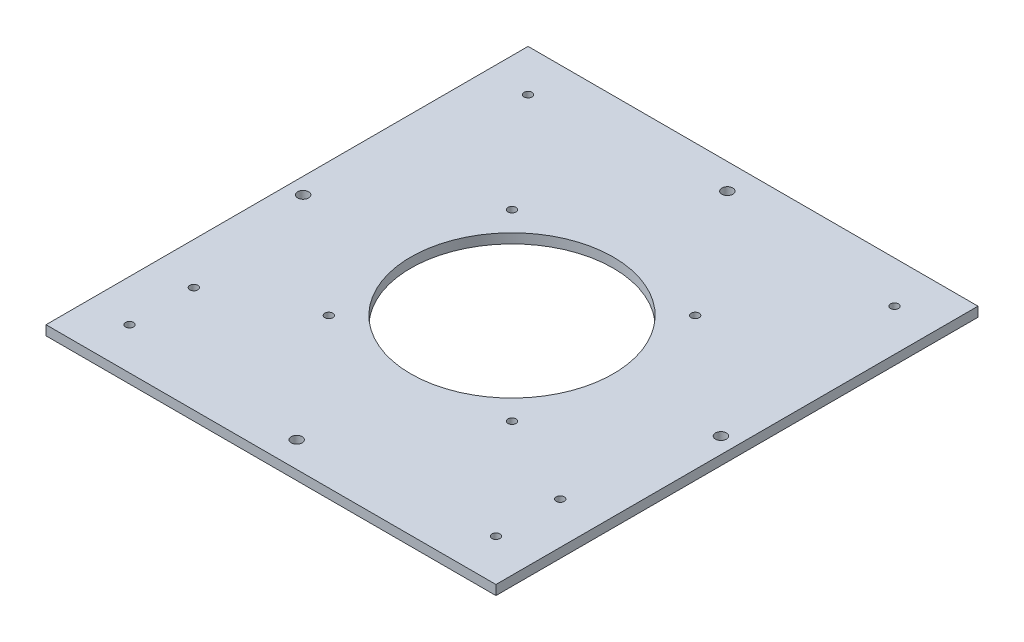
ISO-10303-21;
HEADER;
FILE_DESCRIPTION(('STEP AP214'),'2;1');
FILE_NAME('part.step','',(''),(''),'','','');
FILE_SCHEMA(('AUTOMOTIVE_DESIGN { 1 0 10303 214 1 1 1 1 }'));
ENDSEC;
DATA;
#1=APPLICATION_CONTEXT('core data for automotive mechanical design processes');
#2=APPLICATION_PROTOCOL_DEFINITION('international standard','automotive_design',2000,#1);
#3=PRODUCT_CONTEXT('',#1,'mechanical');
#4=PRODUCT('Part','Part','',(#3));
#5=PRODUCT_RELATED_PRODUCT_CATEGORY('part','',(#4));
#6=PRODUCT_DEFINITION_FORMATION('','',#4);
#7=PRODUCT_DEFINITION_CONTEXT('part definition',#1,'design');
#8=PRODUCT_DEFINITION('design','',#6,#7);
#9=PRODUCT_DEFINITION_SHAPE('','',#8);
#10=(LENGTH_UNIT() NAMED_UNIT(*) SI_UNIT(.MILLI.,.METRE.));
#11=(NAMED_UNIT(*) PLANE_ANGLE_UNIT() SI_UNIT($,.RADIAN.));
#12=(NAMED_UNIT(*) SI_UNIT($,.STERADIAN.) SOLID_ANGLE_UNIT());
#13=UNCERTAINTY_MEASURE_WITH_UNIT(LENGTH_MEASURE(1.E-05),#10,'distance_accuracy_value','');
#14=(GEOMETRIC_REPRESENTATION_CONTEXT(3) GLOBAL_UNCERTAINTY_ASSIGNED_CONTEXT((#13)) GLOBAL_UNIT_ASSIGNED_CONTEXT((#10,
#11,#12)) REPRESENTATION_CONTEXT('',''));
#15=CARTESIAN_POINT('',(0.,0.,0.));
#16=DIRECTION('',(0.,0.,1.));
#17=DIRECTION('',(1.,0.,0.));
#18=AXIS2_PLACEMENT_3D('',#15,#16,#17);
#19=CARTESIAN_POINT('',(12.,224.057982809084,290.032139168121));
#20=DIRECTION('',(0.,1.,0.));
#21=DIRECTION('',(0.,0.,1.));
#22=AXIS2_PLACEMENT_3D('',#19,#20,#21);
#23=PLANE('',#22);
#24=CARTESIAN_POINT('',(139.,224.057982809084,137.));
#25=DIRECTION('',(0.,-1.,0.));
#26=DIRECTION('',(0.,0.,-1.));
#27=AXIS2_PLACEMENT_3D('',#24,#25,#26);
#28=CIRCLE('',#27,1.25);
#29=CARTESIAN_POINT('',(139.,224.057982809084,135.75));
#30=VERTEX_POINT('',#29);
#31=EDGE_CURVE('E135',#30,#30,#28,.T.);
#32=ORIENTED_EDGE('',*,*,#31,.F.);
#33=EDGE_LOOP('',(#32));
#34=FACE_BOUND('',#33,.T.);
#35=CARTESIAN_POINT('',(139.,224.057982809084,117.));
#36=DIRECTION('',(0.,-1.,0.));
#37=DIRECTION('',(0.,0.,-1.));
#38=AXIS2_PLACEMENT_3D('',#35,#36,#37);
#39=CIRCLE('',#38,1.25);
#40=CARTESIAN_POINT('',(139.,224.057982809084,115.75));
#41=VERTEX_POINT('',#40);
#42=EDGE_CURVE('E139',#41,#41,#39,.T.);
#43=ORIENTED_EDGE('',*,*,#42,.F.);
#44=EDGE_LOOP('',(#43));
#45=FACE_BOUND('',#44,.T.);
#46=CARTESIAN_POINT('',(139.,224.057982809084,13.));
#47=DIRECTION('',(0.,-1.,0.));
#48=DIRECTION('',(0.,0.,-1.));
#49=AXIS2_PLACEMENT_3D('',#46,#47,#48);
#50=CIRCLE('',#49,1.25);
#51=CARTESIAN_POINT('',(139.,224.057982809084,11.75));
#52=VERTEX_POINT('',#51);
#53=EDGE_CURVE('E143',#52,#52,#50,.T.);
#54=ORIENTED_EDGE('',*,*,#53,.F.);
#55=EDGE_LOOP('',(#54));
#56=FACE_BOUND('',#55,.T.);
#57=CARTESIAN_POINT('',(25.,224.057982809084,137.));
#58=DIRECTION('',(0.,-1.,0.));
#59=DIRECTION('',(0.,0.,-1.));
#60=AXIS2_PLACEMENT_3D('',#57,#58,#59);
#61=CIRCLE('',#60,1.25);
#62=CARTESIAN_POINT('',(25.,224.057982809084,135.75));
#63=VERTEX_POINT('',#62);
#64=EDGE_CURVE('E147',#63,#63,#61,.T.);
#65=ORIENTED_EDGE('',*,*,#64,.F.);
#66=EDGE_LOOP('',(#65));
#67=FACE_BOUND('',#66,.T.);
#68=CARTESIAN_POINT('',(25.,224.057982809084,117.));
#69=DIRECTION('',(0.,-1.,0.));
#70=DIRECTION('',(0.,0.,-1.));
#71=AXIS2_PLACEMENT_3D('',#68,#69,#70);
#72=CIRCLE('',#71,1.25);
#73=CARTESIAN_POINT('',(25.,224.057982809084,115.75));
#74=VERTEX_POINT('',#73);
#75=EDGE_CURVE('E151',#74,#74,#72,.T.);
#76=ORIENTED_EDGE('',*,*,#75,.F.);
#77=EDGE_LOOP('',(#76));
#78=FACE_BOUND('',#77,.T.);
#79=CARTESIAN_POINT('',(25.,224.057982809084,13.));
#80=DIRECTION('',(0.,-1.,0.));
#81=DIRECTION('',(0.,0.,-1.));
#82=AXIS2_PLACEMENT_3D('',#79,#80,#81);
#83=CIRCLE('',#82,1.25);
#84=CARTESIAN_POINT('',(25.,224.057982809084,11.75));
#85=VERTEX_POINT('',#84);
#86=EDGE_CURVE('E155',#85,#85,#83,.T.);
#87=ORIENTED_EDGE('',*,*,#86,.F.);
#88=EDGE_LOOP('',(#87));
#89=FACE_BOUND('',#88,.T.);
#90=CARTESIAN_POINT('',(82.,224.057982809084,142.));
#91=DIRECTION('',(0.,-1.,0.));
#92=DIRECTION('',(0.,0.,-1.));
#93=AXIS2_PLACEMENT_3D('',#90,#91,#92);
#94=CIRCLE('',#93,1.69999999999999);
#95=CARTESIAN_POINT('',(82.,224.057982809084,140.3));
#96=VERTEX_POINT('',#95);
#97=EDGE_CURVE('E159',#96,#96,#94,.T.);
#98=ORIENTED_EDGE('',*,*,#97,.F.);
#99=EDGE_LOOP('',(#98));
#100=FACE_BOUND('',#99,.T.);
#101=CARTESIAN_POINT('',(147.,224.057982809084,75.));
#102=DIRECTION('',(0.,-1.,0.));
#103=DIRECTION('',(0.,0.,-1.));
#104=AXIS2_PLACEMENT_3D('',#101,#102,#103);
#105=CIRCLE('',#104,1.70000000000001);
#106=CARTESIAN_POINT('',(147.,224.057982809084,73.3));
#107=VERTEX_POINT('',#106);
#108=EDGE_CURVE('E163',#107,#107,#105,.T.);
#109=ORIENTED_EDGE('',*,*,#108,.F.);
#110=EDGE_LOOP('',(#109));
#111=FACE_BOUND('',#110,.T.);
#112=CARTESIAN_POINT('',(82.,224.057982809084,7.99999999999998));
#113=DIRECTION('',(0.,-1.,0.));
#114=DIRECTION('',(0.,0.,-1.));
#115=AXIS2_PLACEMENT_3D('',#112,#113,#114);
#116=CIRCLE('',#115,1.69999999999999);
#117=CARTESIAN_POINT('',(82.,224.057982809084,6.29999999999999));
#118=VERTEX_POINT('',#117);
#119=EDGE_CURVE('E167',#118,#118,#116,.T.);
#120=ORIENTED_EDGE('',*,*,#119,.F.);
#121=EDGE_LOOP('',(#120));
#122=FACE_BOUND('',#121,.T.);
#123=CARTESIAN_POINT('',(17.,224.057982809084,75.));
#124=DIRECTION('',(0.,-1.,0.));
#125=DIRECTION('',(0.,0.,-1.));
#126=AXIS2_PLACEMENT_3D('',#123,#124,#125);
#127=CIRCLE('',#126,1.7);
#128=CARTESIAN_POINT('',(17.,224.057982809084,73.3));
#129=VERTEX_POINT('',#128);
#130=EDGE_CURVE('E171',#129,#129,#127,.T.);
#131=ORIENTED_EDGE('',*,*,#130,.F.);
#132=EDGE_LOOP('',(#131));
#133=FACE_BOUND('',#132,.T.);
#134=CARTESIAN_POINT('',(53.5,224.057982809084,103.5));
#135=DIRECTION('',(0.,-1.,0.));
#136=DIRECTION('',(0.,0.,-1.));
#137=AXIS2_PLACEMENT_3D('',#134,#135,#136);
#138=CIRCLE('',#137,1.24999999999999);
#139=CARTESIAN_POINT('',(53.5,224.057982809084,102.25));
#140=VERTEX_POINT('',#139);
#141=EDGE_CURVE('E175',#140,#140,#138,.T.);
#142=ORIENTED_EDGE('',*,*,#141,.F.);
#143=EDGE_LOOP('',(#142));
#144=FACE_BOUND('',#143,.T.);
#145=CARTESIAN_POINT('',(53.5,224.057982809084,46.5));
#146=DIRECTION('',(0.,-1.,0.));
#147=DIRECTION('',(0.,0.,-1.));
#148=AXIS2_PLACEMENT_3D('',#145,#146,#147);
#149=CIRCLE('',#148,1.24999999999999);
#150=CARTESIAN_POINT('',(53.5,224.057982809084,45.25));
#151=VERTEX_POINT('',#150);
#152=EDGE_CURVE('E179',#151,#151,#149,.T.);
#153=ORIENTED_EDGE('',*,*,#152,.F.);
#154=EDGE_LOOP('',(#153));
#155=FACE_BOUND('',#154,.T.);
#156=CARTESIAN_POINT('',(110.5,224.057982809084,103.5));
#157=DIRECTION('',(0.,-1.,0.));
#158=DIRECTION('',(0.,0.,-1.));
#159=AXIS2_PLACEMENT_3D('',#156,#157,#158);
#160=CIRCLE('',#159,1.24999999999999);
#161=CARTESIAN_POINT('',(110.5,224.057982809084,102.25));
#162=VERTEX_POINT('',#161);
#163=EDGE_CURVE('E183',#162,#162,#160,.T.);
#164=ORIENTED_EDGE('',*,*,#163,.F.);
#165=EDGE_LOOP('',(#164));
#166=FACE_BOUND('',#165,.T.);
#167=CARTESIAN_POINT('',(82.,224.057982809084,75.));
#168=DIRECTION('',(0.,-1.,0.));
#169=DIRECTION('',(0.,0.,-1.));
#170=AXIS2_PLACEMENT_3D('',#167,#168,#169);
#171=CIRCLE('',#170,31.5);
#172=CARTESIAN_POINT('',(82.,224.057982809084,43.5));
#173=VERTEX_POINT('',#172);
#174=EDGE_CURVE('E92',#173,#173,#171,.T.);
#175=ORIENTED_EDGE('',*,*,#174,.F.);
#176=EDGE_LOOP('',(#175));
#177=FACE_BOUND('',#176,.T.);
#178=DIRECTION('',(0.,0.,-1.));
#179=VECTOR('',#178,1.);
#180=CARTESIAN_POINT('',(152.,224.057982809084,290.032139168121));
#181=LINE('',#180,#179);
#182=CARTESIAN_POINT('',(152.,224.057982809084,150.));
#183=VERTEX_POINT('',#182);
#184=CARTESIAN_POINT('',(152.,224.057982809084,0.));
#185=VERTEX_POINT('',#184);
#186=EDGE_CURVE('E74',#183,#185,#181,.T.);
#187=ORIENTED_EDGE('',*,*,#186,.F.);
#188=DIRECTION('',(-1.,0.,0.));
#189=VECTOR('',#188,1.);
#190=CARTESIAN_POINT('',(12.,224.057982809084,150.));
#191=LINE('',#190,#189);
#192=CARTESIAN_POINT('',(12.,224.057982809084,150.));
#193=VERTEX_POINT('',#192);
#194=EDGE_CURVE('E44',#183,#193,#191,.T.);
#195=ORIENTED_EDGE('',*,*,#194,.T.);
#196=DIRECTION('',(0.,0.,-1.));
#197=VECTOR('',#196,1.);
#198=CARTESIAN_POINT('',(12.,224.057982809084,290.032139168121));
#199=LINE('',#198,#197);
#200=CARTESIAN_POINT('',(12.,224.057982809084,0.));
#201=VERTEX_POINT('',#200);
#202=EDGE_CURVE('E88',#193,#201,#199,.T.);
#203=ORIENTED_EDGE('',*,*,#202,.T.);
#204=DIRECTION('',(1.,0.,0.));
#205=VECTOR('',#204,1.);
#206=CARTESIAN_POINT('',(12.,224.057982809084,0.));
#207=LINE('',#206,#205);
#208=EDGE_CURVE('E85',#201,#185,#207,.T.);
#209=ORIENTED_EDGE('',*,*,#208,.T.);
#210=EDGE_LOOP('',(#187,#195,#203,#209));
#211=FACE_BOUND('',#210,.T.);
#212=CARTESIAN_POINT('',(110.5,224.057982809084,46.5));
#213=DIRECTION('',(0.,-1.,0.));
#214=DIRECTION('',(0.,0.,-1.));
#215=AXIS2_PLACEMENT_3D('',#212,#213,#214);
#216=CIRCLE('',#215,1.24999999999999);
#217=CARTESIAN_POINT('',(110.5,224.057982809084,45.25));
#218=VERTEX_POINT('',#217);
#219=EDGE_CURVE('E196',#218,#218,#216,.T.);
#220=ORIENTED_EDGE('',*,*,#219,.F.);
#221=EDGE_LOOP('',(#220));
#222=FACE_BOUND('',#221,.T.);
#223=ADVANCED_FACE('F37',(#34,#45,#56,#67,#78,#89,#100,#111,#122,#133,#144,#155,#166,#177,#211,
#222),#23,.F.);
#224=CARTESIAN_POINT('',(12.,227.057982809084,290.032139168121));
#225=DIRECTION('',(0.,1.,0.));
#226=DIRECTION('',(0.,0.,1.));
#227=AXIS2_PLACEMENT_3D('',#224,#225,#226);
#228=PLANE('',#227);
#229=CARTESIAN_POINT('',(139.,227.057982809084,137.));
#230=DIRECTION('',(0.,-1.,0.));
#231=DIRECTION('',(0.,0.,-1.));
#232=AXIS2_PLACEMENT_3D('',#229,#230,#231);
#233=CIRCLE('',#232,1.25);
#234=CARTESIAN_POINT('',(139.,227.057982809084,135.75));
#235=VERTEX_POINT('',#234);
#236=EDGE_CURVE('E243',#235,#235,#233,.T.);
#237=ORIENTED_EDGE('',*,*,#236,.T.);
#238=EDGE_LOOP('',(#237));
#239=FACE_BOUND('',#238,.T.);
#240=CARTESIAN_POINT('',(139.,227.057982809084,117.));
#241=DIRECTION('',(0.,-1.,0.));
#242=DIRECTION('',(0.,0.,-1.));
#243=AXIS2_PLACEMENT_3D('',#240,#241,#242);
#244=CIRCLE('',#243,1.25);
#245=CARTESIAN_POINT('',(139.,227.057982809084,115.75));
#246=VERTEX_POINT('',#245);
#247=EDGE_CURVE('E239',#246,#246,#244,.T.);
#248=ORIENTED_EDGE('',*,*,#247,.T.);
#249=EDGE_LOOP('',(#248));
#250=FACE_BOUND('',#249,.T.);
#251=CARTESIAN_POINT('',(139.,227.057982809084,13.));
#252=DIRECTION('',(0.,-1.,0.));
#253=DIRECTION('',(0.,0.,-1.));
#254=AXIS2_PLACEMENT_3D('',#251,#252,#253);
#255=CIRCLE('',#254,1.25);
#256=CARTESIAN_POINT('',(139.,227.057982809084,11.75));
#257=VERTEX_POINT('',#256);
#258=EDGE_CURVE('E235',#257,#257,#255,.T.);
#259=ORIENTED_EDGE('',*,*,#258,.T.);
#260=EDGE_LOOP('',(#259));
#261=FACE_BOUND('',#260,.T.);
#262=CARTESIAN_POINT('',(25.,227.057982809084,137.));
#263=DIRECTION('',(0.,-1.,0.));
#264=DIRECTION('',(0.,0.,-1.));
#265=AXIS2_PLACEMENT_3D('',#262,#263,#264);
#266=CIRCLE('',#265,1.25);
#267=CARTESIAN_POINT('',(25.,227.057982809084,135.75));
#268=VERTEX_POINT('',#267);
#269=EDGE_CURVE('E231',#268,#268,#266,.T.);
#270=ORIENTED_EDGE('',*,*,#269,.T.);
#271=EDGE_LOOP('',(#270));
#272=FACE_BOUND('',#271,.T.);
#273=CARTESIAN_POINT('',(25.,227.057982809084,117.));
#274=DIRECTION('',(0.,-1.,0.));
#275=DIRECTION('',(0.,0.,-1.));
#276=AXIS2_PLACEMENT_3D('',#273,#274,#275);
#277=CIRCLE('',#276,1.25);
#278=CARTESIAN_POINT('',(25.,227.057982809084,115.75));
#279=VERTEX_POINT('',#278);
#280=EDGE_CURVE('E227',#279,#279,#277,.T.);
#281=ORIENTED_EDGE('',*,*,#280,.T.);
#282=EDGE_LOOP('',(#281));
#283=FACE_BOUND('',#282,.T.);
#284=CARTESIAN_POINT('',(25.,227.057982809084,13.));
#285=DIRECTION('',(0.,-1.,0.));
#286=DIRECTION('',(0.,0.,-1.));
#287=AXIS2_PLACEMENT_3D('',#284,#285,#286);
#288=CIRCLE('',#287,1.25);
#289=CARTESIAN_POINT('',(25.,227.057982809084,11.75));
#290=VERTEX_POINT('',#289);
#291=EDGE_CURVE('E223',#290,#290,#288,.T.);
#292=ORIENTED_EDGE('',*,*,#291,.T.);
#293=EDGE_LOOP('',(#292));
#294=FACE_BOUND('',#293,.T.);
#295=CARTESIAN_POINT('',(82.,227.057982809084,142.));
#296=DIRECTION('',(0.,-1.,0.));
#297=DIRECTION('',(0.,0.,-1.));
#298=AXIS2_PLACEMENT_3D('',#295,#296,#297);
#299=CIRCLE('',#298,1.69999999999999);
#300=CARTESIAN_POINT('',(82.,227.057982809084,140.3));
#301=VERTEX_POINT('',#300);
#302=EDGE_CURVE('E219',#301,#301,#299,.T.);
#303=ORIENTED_EDGE('',*,*,#302,.T.);
#304=EDGE_LOOP('',(#303));
#305=FACE_BOUND('',#304,.T.);
#306=CARTESIAN_POINT('',(147.,227.057982809084,75.));
#307=DIRECTION('',(0.,-1.,0.));
#308=DIRECTION('',(0.,0.,-1.));
#309=AXIS2_PLACEMENT_3D('',#306,#307,#308);
#310=CIRCLE('',#309,1.70000000000001);
#311=CARTESIAN_POINT('',(147.,227.057982809084,73.3));
#312=VERTEX_POINT('',#311);
#313=EDGE_CURVE('E215',#312,#312,#310,.T.);
#314=ORIENTED_EDGE('',*,*,#313,.T.);
#315=EDGE_LOOP('',(#314));
#316=FACE_BOUND('',#315,.T.);
#317=CARTESIAN_POINT('',(82.,227.057982809084,7.99999999999998));
#318=DIRECTION('',(0.,-1.,0.));
#319=DIRECTION('',(0.,0.,-1.));
#320=AXIS2_PLACEMENT_3D('',#317,#318,#319);
#321=CIRCLE('',#320,1.69999999999999);
#322=CARTESIAN_POINT('',(82.,227.057982809084,6.29999999999999));
#323=VERTEX_POINT('',#322);
#324=EDGE_CURVE('E211',#323,#323,#321,.T.);
#325=ORIENTED_EDGE('',*,*,#324,.T.);
#326=EDGE_LOOP('',(#325));
#327=FACE_BOUND('',#326,.T.);
#328=CARTESIAN_POINT('',(17.,227.057982809084,75.));
#329=DIRECTION('',(0.,-1.,0.));
#330=DIRECTION('',(0.,0.,-1.));
#331=AXIS2_PLACEMENT_3D('',#328,#329,#330);
#332=CIRCLE('',#331,1.7);
#333=CARTESIAN_POINT('',(17.,227.057982809084,73.3));
#334=VERTEX_POINT('',#333);
#335=EDGE_CURVE('E207',#334,#334,#332,.T.);
#336=ORIENTED_EDGE('',*,*,#335,.T.);
#337=EDGE_LOOP('',(#336));
#338=FACE_BOUND('',#337,.T.);
#339=CARTESIAN_POINT('',(53.5,227.057982809084,103.5));
#340=DIRECTION('',(0.,-1.,0.));
#341=DIRECTION('',(0.,0.,-1.));
#342=AXIS2_PLACEMENT_3D('',#339,#340,#341);
#343=CIRCLE('',#342,1.25);
#344=CARTESIAN_POINT('',(53.5,227.057982809084,102.25));
#345=VERTEX_POINT('',#344);
#346=EDGE_CURVE('E203',#345,#345,#343,.T.);
#347=ORIENTED_EDGE('',*,*,#346,.T.);
#348=EDGE_LOOP('',(#347));
#349=FACE_BOUND('',#348,.T.);
#350=CARTESIAN_POINT('',(53.5,227.057982809084,46.5));
#351=DIRECTION('',(0.,-1.,0.));
#352=DIRECTION('',(0.,0.,-1.));
#353=AXIS2_PLACEMENT_3D('',#350,#351,#352);
#354=CIRCLE('',#353,1.25);
#355=CARTESIAN_POINT('',(53.5,227.057982809084,45.25));
#356=VERTEX_POINT('',#355);
#357=EDGE_CURVE('E199',#356,#356,#354,.T.);
#358=ORIENTED_EDGE('',*,*,#357,.T.);
#359=EDGE_LOOP('',(#358));
#360=FACE_BOUND('',#359,.T.);
#361=DIRECTION('',(-1.,0.,0.));
#362=VECTOR('',#361,1.);
#363=CARTESIAN_POINT('',(12.,227.057982809084,150.));
#364=LINE('',#363,#362);
#365=CARTESIAN_POINT('',(152.,227.057982809084,150.));
#366=VERTEX_POINT('',#365);
#367=CARTESIAN_POINT('',(12.,227.057982809084,150.));
#368=VERTEX_POINT('',#367);
#369=EDGE_CURVE('E82',#366,#368,#364,.T.);
#370=ORIENTED_EDGE('',*,*,#369,.F.);
#371=DIRECTION('',(0.,0.,-1.));
#372=VECTOR('',#371,1.);
#373=CARTESIAN_POINT('',(152.,227.057982809084,290.032139168121));
#374=LINE('',#373,#372);
#375=CARTESIAN_POINT('',(152.,227.057982809084,0.));
#376=VERTEX_POINT('',#375);
#377=EDGE_CURVE('E83',#366,#376,#374,.T.);
#378=ORIENTED_EDGE('',*,*,#377,.T.);
#379=DIRECTION('',(1.,0.,0.));
#380=VECTOR('',#379,1.);
#381=CARTESIAN_POINT('',(12.,227.057982809084,0.));
#382=LINE('',#381,#380);
#383=CARTESIAN_POINT('',(12.,227.057982809084,0.));
#384=VERTEX_POINT('',#383);
#385=EDGE_CURVE('E96',#384,#376,#382,.T.);
#386=ORIENTED_EDGE('',*,*,#385,.F.);
#387=DIRECTION('',(0.,0.,-1.));
#388=VECTOR('',#387,1.);
#389=CARTESIAN_POINT('',(12.,227.057982809084,290.032139168121));
#390=LINE('',#389,#388);
#391=EDGE_CURVE('E104',#368,#384,#390,.T.);
#392=ORIENTED_EDGE('',*,*,#391,.F.);
#393=EDGE_LOOP('',(#370,#378,#386,#392));
#394=FACE_BOUND('',#393,.T.);
#395=CARTESIAN_POINT('',(82.,227.057982809084,75.));
#396=DIRECTION('',(0.,1.,0.));
#397=DIRECTION('',(0.,0.,1.));
#398=AXIS2_PLACEMENT_3D('',#395,#396,#397);
#399=CIRCLE('',#398,31.5);
#400=CARTESIAN_POINT('',(82.,227.057982809084,106.5));
#401=VERTEX_POINT('',#400);
#402=EDGE_CURVE('E113',#401,#401,#399,.F.);
#403=ORIENTED_EDGE('',*,*,#402,.T.);
#404=EDGE_LOOP('',(#403));
#405=FACE_BOUND('',#404,.T.);
#406=CARTESIAN_POINT('',(110.5,227.057982809084,103.5));
#407=DIRECTION('',(0.,-1.,0.));
#408=DIRECTION('',(0.,0.,-1.));
#409=AXIS2_PLACEMENT_3D('',#406,#407,#408);
#410=CIRCLE('',#409,1.25);
#411=CARTESIAN_POINT('',(110.5,227.057982809084,102.25));
#412=VERTEX_POINT('',#411);
#413=EDGE_CURVE('E188',#412,#412,#410,.T.);
#414=ORIENTED_EDGE('',*,*,#413,.T.);
#415=EDGE_LOOP('',(#414));
#416=FACE_BOUND('',#415,.T.);
#417=CARTESIAN_POINT('',(110.5,227.057982809084,46.5));
#418=DIRECTION('',(0.,-1.,0.));
#419=DIRECTION('',(0.,0.,-1.));
#420=AXIS2_PLACEMENT_3D('',#417,#418,#419);
#421=CIRCLE('',#420,1.25);
#422=CARTESIAN_POINT('',(110.5,227.057982809084,45.25));
#423=VERTEX_POINT('',#422);
#424=EDGE_CURVE('E193',#423,#423,#421,.T.);
#425=ORIENTED_EDGE('',*,*,#424,.T.);
#426=EDGE_LOOP('',(#425));
#427=FACE_BOUND('',#426,.T.);
#428=ADVANCED_FACE('F107',(#239,#250,#261,#272,#283,#294,#305,#316,#327,#338,#349,#360,#394,
#405,#416,#427),#228,.T.);
#429=CARTESIAN_POINT('',(152.,227.057982809084,290.032139168121));
#430=DIRECTION('',(1.,0.,0.));
#431=DIRECTION('',(0.,0.,-1.));
#432=AXIS2_PLACEMENT_3D('',#429,#430,#431);
#433=PLANE('',#432);
#434=DIRECTION('',(0.,1.,0.));
#435=VECTOR('',#434,1.);
#436=CARTESIAN_POINT('',(152.,227.057982809084,150.));
#437=LINE('',#436,#435);
#438=EDGE_CURVE('E51',#183,#366,#437,.T.);
#439=ORIENTED_EDGE('',*,*,#438,.F.);
#440=ORIENTED_EDGE('',*,*,#186,.T.);
#441=DIRECTION('',(0.,-1.,0.));
#442=VECTOR('',#441,1.);
#443=CARTESIAN_POINT('',(152.,227.057982809084,0.));
#444=LINE('',#443,#442);
#445=EDGE_CURVE('E79',#376,#185,#444,.T.);
#446=ORIENTED_EDGE('',*,*,#445,.F.);
#447=ORIENTED_EDGE('',*,*,#377,.F.);
#448=EDGE_LOOP('',(#439,#440,#446,#447));
#449=FACE_BOUND('',#448,.T.);
#450=ADVANCED_FACE('F76',(#449),#433,.T.);
#451=CARTESIAN_POINT('',(12.,224.057982809084,290.032139168121));
#452=DIRECTION('',(-1.,0.,0.));
#453=DIRECTION('',(0.,0.,1.));
#454=AXIS2_PLACEMENT_3D('',#451,#452,#453);
#455=PLANE('',#454);
#456=DIRECTION('',(0.,-1.,0.));
#457=VECTOR('',#456,1.);
#458=CARTESIAN_POINT('',(12.,224.057982809084,150.));
#459=LINE('',#458,#457);
#460=EDGE_CURVE('E11',#368,#193,#459,.T.);
#461=ORIENTED_EDGE('',*,*,#460,.F.);
#462=ORIENTED_EDGE('',*,*,#391,.T.);
#463=DIRECTION('',(0.,1.,0.));
#464=VECTOR('',#463,1.);
#465=CARTESIAN_POINT('',(12.,224.057982809084,0.));
#466=LINE('',#465,#464);
#467=EDGE_CURVE('E98',#201,#384,#466,.T.);
#468=ORIENTED_EDGE('',*,*,#467,.F.);
#469=ORIENTED_EDGE('',*,*,#202,.F.);
#470=EDGE_LOOP('',(#461,#462,#468,#469));
#471=FACE_BOUND('',#470,.T.);
#472=ADVANCED_FACE('F116',(#471),#455,.T.);
#473=CARTESIAN_POINT('',(0.,0.,0.));
#474=DIRECTION('',(0.,0.,-1.));
#475=DIRECTION('',(-1.,0.,0.));
#476=AXIS2_PLACEMENT_3D('',#473,#474,#475);
#477=PLANE('',#476);
#478=ORIENTED_EDGE('',*,*,#208,.F.);
#479=ORIENTED_EDGE('',*,*,#467,.T.);
#480=ORIENTED_EDGE('',*,*,#385,.T.);
#481=ORIENTED_EDGE('',*,*,#445,.T.);
#482=EDGE_LOOP('',(#478,#479,#480,#481));
#483=FACE_BOUND('',#482,.T.);
#484=ADVANCED_FACE('F94',(#483),#477,.T.);
#485=CARTESIAN_POINT('',(0.,0.,150.));
#486=DIRECTION('',(0.,0.,-1.));
#487=DIRECTION('',(-1.,0.,0.));
#488=AXIS2_PLACEMENT_3D('',#485,#486,#487);
#489=PLANE('',#488);
#490=ORIENTED_EDGE('',*,*,#438,.T.);
#491=ORIENTED_EDGE('',*,*,#369,.T.);
#492=ORIENTED_EDGE('',*,*,#460,.T.);
#493=ORIENTED_EDGE('',*,*,#194,.F.);
#494=EDGE_LOOP('',(#490,#491,#492,#493));
#495=FACE_BOUND('',#494,.T.);
#496=ADVANCED_FACE('F123',(#495),#489,.F.);
#497=CARTESIAN_POINT('',(82.,227.058982809084,75.));
#498=DIRECTION('',(0.,-1.,0.));
#499=DIRECTION('',(0.,0.,-1.));
#500=AXIS2_PLACEMENT_3D('',#497,#498,#499);
#501=CYLINDRICAL_SURFACE('',#500,31.5);
#502=ORIENTED_EDGE('',*,*,#402,.F.);
#503=EDGE_LOOP('',(#502));
#504=FACE_BOUND('',#503,.T.);
#505=ORIENTED_EDGE('',*,*,#174,.T.);
#506=EDGE_LOOP('',(#505));
#507=FACE_BOUND('',#506,.T.);
#508=ADVANCED_FACE('F306',(#504,#507),#501,.F.);
#509=CARTESIAN_POINT('',(110.5,224.057982809084,103.5));
#510=DIRECTION('',(0.,-1.,0.));
#511=DIRECTION('',(0.,0.,-1.));
#512=AXIS2_PLACEMENT_3D('',#509,#510,#511);
#513=CYLINDRICAL_SURFACE('',#512,1.24999999999999);
#514=ORIENTED_EDGE('',*,*,#413,.F.);
#515=EDGE_LOOP('',(#514));
#516=FACE_BOUND('',#515,.T.);
#517=ORIENTED_EDGE('',*,*,#163,.T.);
#518=EDGE_LOOP('',(#517));
#519=FACE_BOUND('',#518,.T.);
#520=ADVANCED_FACE('F302',(#516,#519),#513,.F.);
#521=CARTESIAN_POINT('',(110.5,224.057982809084,46.5));
#522=DIRECTION('',(0.,-1.,0.));
#523=DIRECTION('',(0.,0.,-1.));
#524=AXIS2_PLACEMENT_3D('',#521,#522,#523);
#525=CYLINDRICAL_SURFACE('',#524,1.24999999999999);
#526=ORIENTED_EDGE('',*,*,#424,.F.);
#527=EDGE_LOOP('',(#526));
#528=FACE_BOUND('',#527,.T.);
#529=ORIENTED_EDGE('',*,*,#219,.T.);
#530=EDGE_LOOP('',(#529));
#531=FACE_BOUND('',#530,.T.);
#532=ADVANCED_FACE('F298',(#528,#531),#525,.F.);
#533=CARTESIAN_POINT('',(53.5,224.057982809084,46.5));
#534=DIRECTION('',(0.,-1.,0.));
#535=DIRECTION('',(0.,0.,-1.));
#536=AXIS2_PLACEMENT_3D('',#533,#534,#535);
#537=CYLINDRICAL_SURFACE('',#536,1.24999999999999);
#538=ORIENTED_EDGE('',*,*,#357,.F.);
#539=EDGE_LOOP('',(#538));
#540=FACE_BOUND('',#539,.T.);
#541=ORIENTED_EDGE('',*,*,#152,.T.);
#542=EDGE_LOOP('',(#541));
#543=FACE_BOUND('',#542,.T.);
#544=ADVANCED_FACE('F294',(#540,#543),#537,.F.);
#545=CARTESIAN_POINT('',(53.5,224.057982809084,103.5));
#546=DIRECTION('',(0.,-1.,0.));
#547=DIRECTION('',(0.,0.,-1.));
#548=AXIS2_PLACEMENT_3D('',#545,#546,#547);
#549=CYLINDRICAL_SURFACE('',#548,1.24999999999999);
#550=ORIENTED_EDGE('',*,*,#346,.F.);
#551=EDGE_LOOP('',(#550));
#552=FACE_BOUND('',#551,.T.);
#553=ORIENTED_EDGE('',*,*,#141,.T.);
#554=EDGE_LOOP('',(#553));
#555=FACE_BOUND('',#554,.T.);
#556=ADVANCED_FACE('F290',(#552,#555),#549,.F.);
#557=CARTESIAN_POINT('',(17.,224.057982809084,75.));
#558=DIRECTION('',(0.,-1.,0.));
#559=DIRECTION('',(0.,0.,-1.));
#560=AXIS2_PLACEMENT_3D('',#557,#558,#559);
#561=CYLINDRICAL_SURFACE('',#560,1.7);
#562=ORIENTED_EDGE('',*,*,#335,.F.);
#563=EDGE_LOOP('',(#562));
#564=FACE_BOUND('',#563,.T.);
#565=ORIENTED_EDGE('',*,*,#130,.T.);
#566=EDGE_LOOP('',(#565));
#567=FACE_BOUND('',#566,.T.);
#568=ADVANCED_FACE('F286',(#564,#567),#561,.F.);
#569=CARTESIAN_POINT('',(82.,224.057982809084,7.99999999999998));
#570=DIRECTION('',(0.,-1.,0.));
#571=DIRECTION('',(0.,0.,-1.));
#572=AXIS2_PLACEMENT_3D('',#569,#570,#571);
#573=CYLINDRICAL_SURFACE('',#572,1.69999999999999);
#574=ORIENTED_EDGE('',*,*,#324,.F.);
#575=EDGE_LOOP('',(#574));
#576=FACE_BOUND('',#575,.T.);
#577=ORIENTED_EDGE('',*,*,#119,.T.);
#578=EDGE_LOOP('',(#577));
#579=FACE_BOUND('',#578,.T.);
#580=ADVANCED_FACE('F282',(#576,#579),#573,.F.);
#581=CARTESIAN_POINT('',(147.,224.057982809084,75.));
#582=DIRECTION('',(0.,-1.,0.));
#583=DIRECTION('',(0.,0.,-1.));
#584=AXIS2_PLACEMENT_3D('',#581,#582,#583);
#585=CYLINDRICAL_SURFACE('',#584,1.70000000000001);
#586=ORIENTED_EDGE('',*,*,#313,.F.);
#587=EDGE_LOOP('',(#586));
#588=FACE_BOUND('',#587,.T.);
#589=ORIENTED_EDGE('',*,*,#108,.T.);
#590=EDGE_LOOP('',(#589));
#591=FACE_BOUND('',#590,.T.);
#592=ADVANCED_FACE('F278',(#588,#591),#585,.F.);
#593=CARTESIAN_POINT('',(82.,224.057982809084,142.));
#594=DIRECTION('',(0.,-1.,0.));
#595=DIRECTION('',(0.,0.,-1.));
#596=AXIS2_PLACEMENT_3D('',#593,#594,#595);
#597=CYLINDRICAL_SURFACE('',#596,1.69999999999999);
#598=ORIENTED_EDGE('',*,*,#302,.F.);
#599=EDGE_LOOP('',(#598));
#600=FACE_BOUND('',#599,.T.);
#601=ORIENTED_EDGE('',*,*,#97,.T.);
#602=EDGE_LOOP('',(#601));
#603=FACE_BOUND('',#602,.T.);
#604=ADVANCED_FACE('F274',(#600,#603),#597,.F.);
#605=CARTESIAN_POINT('',(25.,224.057982809084,13.));
#606=DIRECTION('',(0.,-1.,0.));
#607=DIRECTION('',(0.,0.,-1.));
#608=AXIS2_PLACEMENT_3D('',#605,#606,#607);
#609=CYLINDRICAL_SURFACE('',#608,1.25);
#610=ORIENTED_EDGE('',*,*,#291,.F.);
#611=EDGE_LOOP('',(#610));
#612=FACE_BOUND('',#611,.T.);
#613=ORIENTED_EDGE('',*,*,#86,.T.);
#614=EDGE_LOOP('',(#613));
#615=FACE_BOUND('',#614,.T.);
#616=ADVANCED_FACE('F270',(#612,#615),#609,.F.);
#617=CARTESIAN_POINT('',(25.,224.057982809084,117.));
#618=DIRECTION('',(0.,-1.,0.));
#619=DIRECTION('',(0.,0.,-1.));
#620=AXIS2_PLACEMENT_3D('',#617,#618,#619);
#621=CYLINDRICAL_SURFACE('',#620,1.25);
#622=ORIENTED_EDGE('',*,*,#280,.F.);
#623=EDGE_LOOP('',(#622));
#624=FACE_BOUND('',#623,.T.);
#625=ORIENTED_EDGE('',*,*,#75,.T.);
#626=EDGE_LOOP('',(#625));
#627=FACE_BOUND('',#626,.T.);
#628=ADVANCED_FACE('F266',(#624,#627),#621,.F.);
#629=CARTESIAN_POINT('',(25.,224.057982809084,137.));
#630=DIRECTION('',(0.,-1.,0.));
#631=DIRECTION('',(0.,0.,-1.));
#632=AXIS2_PLACEMENT_3D('',#629,#630,#631);
#633=CYLINDRICAL_SURFACE('',#632,1.25);
#634=ORIENTED_EDGE('',*,*,#269,.F.);
#635=EDGE_LOOP('',(#634));
#636=FACE_BOUND('',#635,.T.);
#637=ORIENTED_EDGE('',*,*,#64,.T.);
#638=EDGE_LOOP('',(#637));
#639=FACE_BOUND('',#638,.T.);
#640=ADVANCED_FACE('F262',(#636,#639),#633,.F.);
#641=CARTESIAN_POINT('',(139.,224.057982809084,13.));
#642=DIRECTION('',(0.,-1.,0.));
#643=DIRECTION('',(0.,0.,-1.));
#644=AXIS2_PLACEMENT_3D('',#641,#642,#643);
#645=CYLINDRICAL_SURFACE('',#644,1.25);
#646=ORIENTED_EDGE('',*,*,#258,.F.);
#647=EDGE_LOOP('',(#646));
#648=FACE_BOUND('',#647,.T.);
#649=ORIENTED_EDGE('',*,*,#53,.T.);
#650=EDGE_LOOP('',(#649));
#651=FACE_BOUND('',#650,.T.);
#652=ADVANCED_FACE('F255',(#648,#651),#645,.F.);
#653=CARTESIAN_POINT('',(139.,224.057982809084,117.));
#654=DIRECTION('',(0.,-1.,0.));
#655=DIRECTION('',(0.,0.,-1.));
#656=AXIS2_PLACEMENT_3D('',#653,#654,#655);
#657=CYLINDRICAL_SURFACE('',#656,1.25);
#658=ORIENTED_EDGE('',*,*,#247,.F.);
#659=EDGE_LOOP('',(#658));
#660=FACE_BOUND('',#659,.T.);
#661=ORIENTED_EDGE('',*,*,#42,.T.);
#662=EDGE_LOOP('',(#661));
#663=FACE_BOUND('',#662,.T.);
#664=ADVANCED_FACE('F249',(#660,#663),#657,.F.);
#665=CARTESIAN_POINT('',(139.,224.057982809084,137.));
#666=DIRECTION('',(0.,-1.,0.));
#667=DIRECTION('',(0.,0.,-1.));
#668=AXIS2_PLACEMENT_3D('',#665,#666,#667);
#669=CYLINDRICAL_SURFACE('',#668,1.25);
#670=ORIENTED_EDGE('',*,*,#236,.F.);
#671=EDGE_LOOP('',(#670));
#672=FACE_BOUND('',#671,.T.);
#673=ORIENTED_EDGE('',*,*,#31,.T.);
#674=EDGE_LOOP('',(#673));
#675=FACE_BOUND('',#674,.T.);
#676=ADVANCED_FACE('F247',(#672,#675),#669,.F.);
#677=CLOSED_SHELL('',(#223,#428,#450,#472,#484,#496,#508,#520,#532,#544,#556,#568,#580,#592,
#604,#616,#628,#640,#652,#664,#676));
#678=MANIFOLD_SOLID_BREP('B2',#677);
#679=ADVANCED_BREP_SHAPE_REPRESENTATION('',(#18,#678),#14);
#680=SHAPE_DEFINITION_REPRESENTATION(#9,#679);
ENDSEC;
END-ISO-10303-21;
